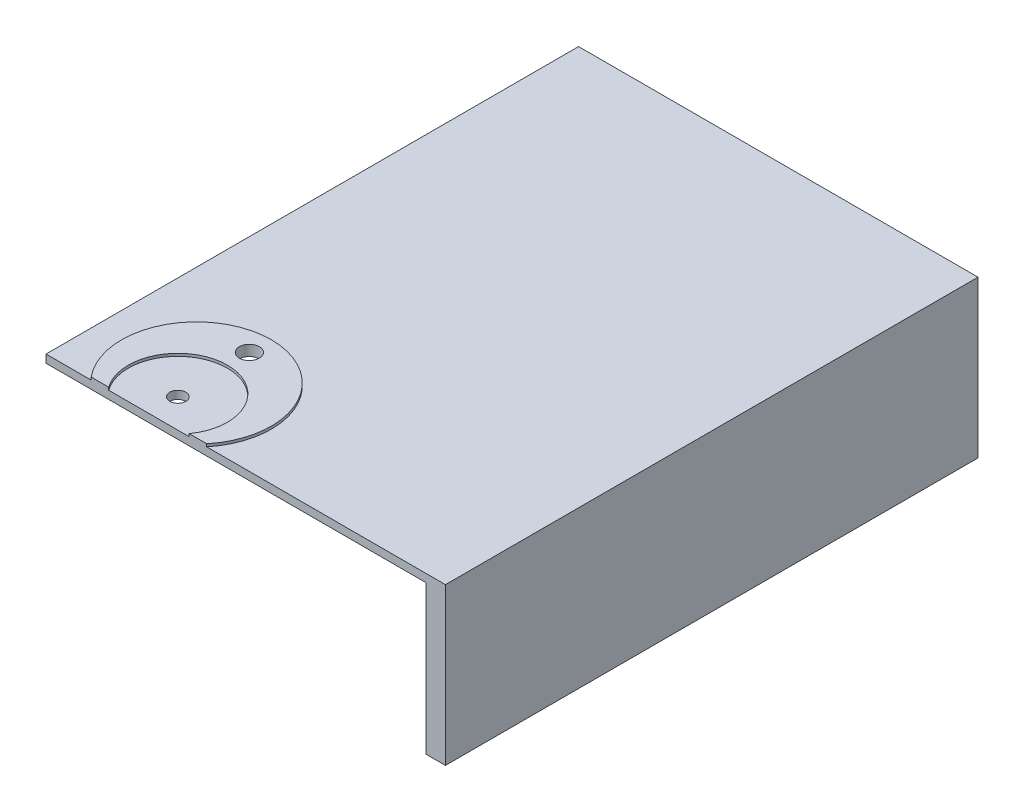
ISO-10303-21;
HEADER;
FILE_DESCRIPTION(('STEP AP214'),'2;1');
FILE_NAME('part.step','',(''),(''),'','','');
FILE_SCHEMA(('AUTOMOTIVE_DESIGN { 1 0 10303 214 1 1 1 1 }'));
ENDSEC;
DATA;
#1=APPLICATION_CONTEXT('core data for automotive mechanical design processes');
#2=APPLICATION_PROTOCOL_DEFINITION('international standard','automotive_design',2000,#1);
#3=PRODUCT_CONTEXT('',#1,'mechanical');
#4=PRODUCT('Part','Part','',(#3));
#5=PRODUCT_RELATED_PRODUCT_CATEGORY('part','',(#4));
#6=PRODUCT_DEFINITION_FORMATION('','',#4);
#7=PRODUCT_DEFINITION_CONTEXT('part definition',#1,'design');
#8=PRODUCT_DEFINITION('design','',#6,#7);
#9=PRODUCT_DEFINITION_SHAPE('','',#8);
#10=(LENGTH_UNIT() NAMED_UNIT(*) SI_UNIT(.MILLI.,.METRE.));
#11=(NAMED_UNIT(*) PLANE_ANGLE_UNIT() SI_UNIT($,.RADIAN.));
#12=(NAMED_UNIT(*) SI_UNIT($,.STERADIAN.) SOLID_ANGLE_UNIT());
#13=UNCERTAINTY_MEASURE_WITH_UNIT(LENGTH_MEASURE(1.E-05),#10,'distance_accuracy_value','');
#14=(GEOMETRIC_REPRESENTATION_CONTEXT(3) GLOBAL_UNCERTAINTY_ASSIGNED_CONTEXT((#13)) GLOBAL_UNIT_ASSIGNED_CONTEXT((#10,
#11,#12)) REPRESENTATION_CONTEXT('',''));
#15=CARTESIAN_POINT('',(0.,0.,0.));
#16=DIRECTION('',(0.,0.,1.));
#17=DIRECTION('',(1.,0.,0.));
#18=AXIS2_PLACEMENT_3D('',#15,#16,#17);
#19=CARTESIAN_POINT('',(0.,1.,0.));
#20=DIRECTION('',(0.,-1.,0.));
#21=DIRECTION('',(0.,0.,-1.));
#22=AXIS2_PLACEMENT_3D('',#19,#20,#21);
#23=CYLINDRICAL_SURFACE('',#22,28.1);
#24=CARTESIAN_POINT('',(0.,1.,0.));
#25=DIRECTION('',(0.,1.,0.));
#26=DIRECTION('',(0.,0.,1.));
#27=AXIS2_PLACEMENT_3D('',#24,#25,#26);
#28=CIRCLE('',#27,28.1);
#29=CARTESIAN_POINT('',(21.695150517663,1.,17.8586237996086));
#30=VERTEX_POINT('',#29);
#31=CARTESIAN_POINT('',(-21.695150517663,1.,17.8586237996086));
#32=VERTEX_POINT('',#31);
#33=EDGE_CURVE('E169',#30,#32,#28,.T.);
#34=ORIENTED_EDGE('',*,*,#33,.F.);
#35=DIRECTION('',(0.,-1.,0.));
#36=VECTOR('',#35,1.);
#37=CARTESIAN_POINT('',(21.695150517663,1.,17.8586237996086));
#38=LINE('',#37,#36);
#39=CARTESIAN_POINT('',(21.695150517663,0.,17.8586237996086));
#40=VERTEX_POINT('',#39);
#41=EDGE_CURVE('E253',#30,#40,#38,.T.);
#42=ORIENTED_EDGE('',*,*,#41,.T.);
#43=CARTESIAN_POINT('',(0.,0.,0.));
#44=DIRECTION('',(0.,1.,0.));
#45=DIRECTION('',(0.,0.,1.));
#46=AXIS2_PLACEMENT_3D('',#43,#44,#45);
#47=CIRCLE('',#46,28.1);
#48=CARTESIAN_POINT('',(-21.695150517663,0.,17.8586237996086));
#49=VERTEX_POINT('',#48);
#50=EDGE_CURVE('E163',#40,#49,#47,.T.);
#51=ORIENTED_EDGE('',*,*,#50,.T.);
#52=DIRECTION('',(0.,-1.,0.));
#53=VECTOR('',#52,1.);
#54=CARTESIAN_POINT('',(-21.695150517663,1.,17.8586237996086));
#55=LINE('',#54,#53);
#56=EDGE_CURVE('E249',#49,#32,#55,.F.);
#57=ORIENTED_EDGE('',*,*,#56,.T.);
#58=EDGE_LOOP('',(#34,#42,#51,#57));
#59=FACE_BOUND('',#58,.T.);
#60=ADVANCED_FACE('F39',(#59),#23,.T.);
#61=CARTESIAN_POINT('',(0.,1.,0.));
#62=DIRECTION('',(0.,1.,0.));
#63=DIRECTION('',(0.,0.,1.));
#64=AXIS2_PLACEMENT_3D('',#61,#62,#63);
#65=PLANE('',#64);
#66=DIRECTION('',(-1.,0.,0.));
#67=VECTOR('',#66,1.);
#68=CARTESIAN_POINT('',(0.,1.,17.8586237996086));
#69=LINE('',#68,#67);
#70=CARTESIAN_POINT('',(15.1013340198333,1.,17.8586237996086));
#71=VERTEX_POINT('',#70);
#72=EDGE_CURVE('E248',#30,#71,#69,.T.);
#73=ORIENTED_EDGE('',*,*,#72,.F.);
#74=ORIENTED_EDGE('',*,*,#33,.T.);
#75=CARTESIAN_POINT('',(-15.1013340198333,1.,17.8586237996086));
#76=VERTEX_POINT('',#75);
#77=EDGE_CURVE('E245',#76,#32,#69,.T.);
#78=ORIENTED_EDGE('',*,*,#77,.F.);
#79=CARTESIAN_POINT('',(0.,1.,7.));
#80=DIRECTION('',(0.,1.,0.));
#81=DIRECTION('',(0.,0.,1.));
#82=AXIS2_PLACEMENT_3D('',#79,#80,#81);
#83=CIRCLE('',#82,18.6);
#84=EDGE_CURVE('E164',#71,#76,#83,.T.);
#85=ORIENTED_EDGE('',*,*,#84,.F.);
#86=EDGE_LOOP('',(#73,#74,#78,#85));
#87=FACE_BOUND('',#86,.T.);
#88=CARTESIAN_POINT('',(0.,1.,-19.85));
#89=DIRECTION('',(0.,1.,0.));
#90=DIRECTION('',(0.,0.,1.));
#91=AXIS2_PLACEMENT_3D('',#88,#89,#90);
#92=CIRCLE('',#91,3.75);
#93=CARTESIAN_POINT('',(0.,1.,-16.1));
#94=VERTEX_POINT('',#93);
#95=EDGE_CURVE('E188',#94,#94,#92,.T.);
#96=ORIENTED_EDGE('',*,*,#95,.F.);
#97=EDGE_LOOP('',(#96));
#98=FACE_BOUND('',#97,.T.);
#99=ADVANCED_FACE('F273',(#87,#98),#65,.T.);
#100=CARTESIAN_POINT('',(0.,-57.8,7.));
#101=DIRECTION('',(0.,1.,0.));
#102=DIRECTION('',(0.,0.,1.));
#103=AXIS2_PLACEMENT_3D('',#100,#101,#102);
#104=CYLINDRICAL_SURFACE('',#103,18.6);
#105=ORIENTED_EDGE('',*,*,#84,.T.);
#106=DIRECTION('',(0.,1.,0.));
#107=VECTOR('',#106,1.);
#108=CARTESIAN_POINT('',(-15.1013340198333,-57.8,17.8586237996086));
#109=LINE('',#108,#107);
#110=CARTESIAN_POINT('',(-15.1013340198333,0.,17.8586237996086));
#111=VERTEX_POINT('',#110);
#112=EDGE_CURVE('E241',#76,#111,#109,.F.);
#113=ORIENTED_EDGE('',*,*,#112,.T.);
#114=CARTESIAN_POINT('',(0.,0.,7.));
#115=DIRECTION('',(0.,1.,0.));
#116=DIRECTION('',(0.,0.,1.));
#117=AXIS2_PLACEMENT_3D('',#114,#115,#116);
#118=CIRCLE('',#117,18.6);
#119=CARTESIAN_POINT('',(15.1013340198333,0.,17.8586237996086));
#120=VERTEX_POINT('',#119);
#121=EDGE_CURVE('E168',#120,#111,#118,.T.);
#122=ORIENTED_EDGE('',*,*,#121,.F.);
#123=DIRECTION('',(0.,1.,0.));
#124=VECTOR('',#123,1.);
#125=CARTESIAN_POINT('',(15.1013340198333,-57.8,17.8586237996086));
#126=LINE('',#125,#124);
#127=EDGE_CURVE('E237',#120,#71,#126,.T.);
#128=ORIENTED_EDGE('',*,*,#127,.T.);
#129=EDGE_LOOP('',(#105,#113,#122,#128));
#130=FACE_BOUND('',#129,.T.);
#131=ADVANCED_FACE('F278',(#130),#104,.F.);
#132=CARTESIAN_POINT('',(0.,0.,0.));
#133=DIRECTION('',(0.,-1.,0.));
#134=DIRECTION('',(0.,0.,-1.));
#135=AXIS2_PLACEMENT_3D('',#132,#133,#134);
#136=PLANE('',#135);
#137=ORIENTED_EDGE('',*,*,#50,.F.);
#138=DIRECTION('',(1.,0.,0.));
#139=VECTOR('',#138,1.);
#140=CARTESIAN_POINT('',(0.,0.,17.8586237996086));
#141=LINE('',#140,#139);
#142=CARTESIAN_POINT('',(111.341546011374,0.,17.8586237996086));
#143=VERTEX_POINT('',#142);
#144=EDGE_CURVE('E257',#40,#143,#141,.T.);
#145=ORIENTED_EDGE('',*,*,#144,.T.);
#146=DIRECTION('',(0.,0.,1.));
#147=VECTOR('',#146,1.);
#148=CARTESIAN_POINT('',(111.341546011374,0.,182.141376200391));
#149=LINE('',#148,#147);
#150=CARTESIAN_POINT('',(111.341546011374,0.,-182.141376200391));
#151=VERTEX_POINT('',#150);
#152=EDGE_CURVE('E142',#151,#143,#149,.T.);
#153=ORIENTED_EDGE('',*,*,#152,.F.);
#154=DIRECTION('',(1.,0.,0.));
#155=VECTOR('',#154,1.);
#156=CARTESIAN_POINT('',(-111.341546011374,0.,-182.141376200391));
#157=LINE('',#156,#155);
#158=CARTESIAN_POINT('',(-38.6584539886257,0.,-182.141376200391));
#159=VERTEX_POINT('',#158);
#160=EDGE_CURVE('E148',#159,#151,#157,.T.);
#161=ORIENTED_EDGE('',*,*,#160,.F.);
#162=DIRECTION('',(0.,0.,1.));
#163=VECTOR('',#162,1.);
#164=CARTESIAN_POINT('',(-38.6584539886258,0.,0.));
#165=LINE('',#164,#163);
#166=CARTESIAN_POINT('',(-38.6584539886258,0.,17.8586237996086));
#167=VERTEX_POINT('',#166);
#168=EDGE_CURVE('E225',#159,#167,#165,.T.);
#169=ORIENTED_EDGE('',*,*,#168,.T.);
#170=EDGE_CURVE('E198',#167,#49,#141,.T.);
#171=ORIENTED_EDGE('',*,*,#170,.T.);
#172=EDGE_LOOP('',(#137,#145,#153,#161,#169,#171));
#173=FACE_BOUND('',#172,.T.);
#174=ADVANCED_FACE('F266',(#173),#136,.F.);
#175=CARTESIAN_POINT('',(0.,-58.8,0.));
#176=DIRECTION('',(0.,-1.,0.));
#177=DIRECTION('',(0.,0.,-1.));
#178=AXIS2_PLACEMENT_3D('',#175,#176,#177);
#179=PLANE('',#178);
#180=DIRECTION('',(1.,0.,0.));
#181=VECTOR('',#180,1.);
#182=CARTESIAN_POINT('',(-38.6584539886258,-58.8,17.8586237996086));
#183=LINE('',#182,#181);
#184=CARTESIAN_POINT('',(103.958701758156,-58.8,17.8586237996086));
#185=VERTEX_POINT('',#184);
#186=CARTESIAN_POINT('',(111.341546011374,-58.8,17.8586237996086));
#187=VERTEX_POINT('',#186);
#188=EDGE_CURVE('E122',#185,#187,#183,.T.);
#189=ORIENTED_EDGE('',*,*,#188,.F.);
#190=DIRECTION('',(0.,0.,1.));
#191=VECTOR('',#190,1.);
#192=CARTESIAN_POINT('',(103.958701758156,-58.8,174.272148859892));
#193=LINE('',#192,#191);
#194=CARTESIAN_POINT('',(103.958701758156,-58.8,-174.272148859892));
#195=VERTEX_POINT('',#194);
#196=EDGE_CURVE('E183',#195,#185,#193,.T.);
#197=ORIENTED_EDGE('',*,*,#196,.F.);
#198=DIRECTION('',(1.,0.,0.));
#199=VECTOR('',#198,1.);
#200=CARTESIAN_POINT('',(-103.958701758156,-58.8,-174.272148859892));
#201=LINE('',#200,#199);
#202=CARTESIAN_POINT('',(-38.6584539886257,-58.8,-174.272148859892));
#203=VERTEX_POINT('',#202);
#204=EDGE_CURVE('E211',#203,#195,#201,.T.);
#205=ORIENTED_EDGE('',*,*,#204,.F.);
#206=DIRECTION('',(0.,0.,1.));
#207=VECTOR('',#206,1.);
#208=CARTESIAN_POINT('',(-38.6584539886257,-58.8,-182.141376200391));
#209=LINE('',#208,#207);
#210=CARTESIAN_POINT('',(-38.6584539886257,-58.8,-182.141376200391));
#211=VERTEX_POINT('',#210);
#212=EDGE_CURVE('E133',#211,#203,#209,.T.);
#213=ORIENTED_EDGE('',*,*,#212,.F.);
#214=DIRECTION('',(1.,0.,0.));
#215=VECTOR('',#214,1.);
#216=CARTESIAN_POINT('',(-111.341546011374,-58.8,-182.141376200391));
#217=LINE('',#216,#215);
#218=CARTESIAN_POINT('',(111.341546011374,-58.8,-182.141376200391));
#219=VERTEX_POINT('',#218);
#220=EDGE_CURVE('E63',#211,#219,#217,.T.);
#221=ORIENTED_EDGE('',*,*,#220,.T.);
#222=DIRECTION('',(0.,0.,1.));
#223=VECTOR('',#222,1.);
#224=CARTESIAN_POINT('',(111.341546011374,-58.8,182.141376200391));
#225=LINE('',#224,#223);
#226=EDGE_CURVE('E140',#219,#187,#225,.T.);
#227=ORIENTED_EDGE('',*,*,#226,.T.);
#228=EDGE_LOOP('',(#189,#197,#205,#213,#221,#227));
#229=FACE_BOUND('',#228,.T.);
#230=ADVANCED_FACE('F146',(#229),#179,.T.);
#231=CARTESIAN_POINT('',(-111.341546011374,-58.8,-182.141376200391));
#232=DIRECTION('',(0.,0.,1.));
#233=DIRECTION('',(1.,0.,0.));
#234=AXIS2_PLACEMENT_3D('',#231,#232,#233);
#235=PLANE('',#234);
#236=ORIENTED_EDGE('',*,*,#220,.F.);
#237=DIRECTION('',(0.,-1.,0.));
#238=VECTOR('',#237,1.);
#239=CARTESIAN_POINT('',(-38.6584539886257,441.2,-182.141376200391));
#240=LINE('',#239,#238);
#241=EDGE_CURVE('E144',#159,#211,#240,.T.);
#242=ORIENTED_EDGE('',*,*,#241,.F.);
#243=ORIENTED_EDGE('',*,*,#160,.T.);
#244=DIRECTION('',(0.,1.,0.));
#245=VECTOR('',#244,1.);
#246=CARTESIAN_POINT('',(111.341546011374,-58.8,-182.141376200391));
#247=LINE('',#246,#245);
#248=EDGE_CURVE('E152',#219,#151,#247,.T.);
#249=ORIENTED_EDGE('',*,*,#248,.F.);
#250=EDGE_LOOP('',(#236,#242,#243,#249));
#251=FACE_BOUND('',#250,.T.);
#252=ADVANCED_FACE('F290',(#251),#235,.F.);
#253=CARTESIAN_POINT('',(111.341546011374,-58.8,182.141376200391));
#254=DIRECTION('',(-1.,0.,0.));
#255=DIRECTION('',(0.,0.,1.));
#256=AXIS2_PLACEMENT_3D('',#253,#254,#255);
#257=PLANE('',#256);
#258=ORIENTED_EDGE('',*,*,#152,.T.);
#259=DIRECTION('',(0.,-1.,0.));
#260=VECTOR('',#259,1.);
#261=CARTESIAN_POINT('',(111.341546011374,441.2,17.8586237996086));
#262=LINE('',#261,#260);
#263=EDGE_CURVE('E126',#143,#187,#262,.T.);
#264=ORIENTED_EDGE('',*,*,#263,.T.);
#265=ORIENTED_EDGE('',*,*,#226,.F.);
#266=ORIENTED_EDGE('',*,*,#248,.T.);
#267=EDGE_LOOP('',(#258,#264,#265,#266));
#268=FACE_BOUND('',#267,.T.);
#269=ADVANCED_FACE('F138',(#268),#257,.F.);
#270=CARTESIAN_POINT('',(0.,0.,7.));
#271=DIRECTION('',(0.,1.,0.));
#272=DIRECTION('',(0.,0.,1.));
#273=AXIS2_PLACEMENT_3D('',#270,#271,#272);
#274=CIRCLE('',#273,3.);
#275=CARTESIAN_POINT('',(0.,0.,10.));
#276=VERTEX_POINT('',#275);
#277=EDGE_CURVE('E184',#276,#276,#274,.T.);
#278=ORIENTED_EDGE('',*,*,#277,.F.);
#279=EDGE_LOOP('',(#278));
#280=FACE_BOUND('',#279,.T.);
#281=ORIENTED_EDGE('',*,*,#121,.T.);
#282=DIRECTION('',(1.,0.,0.));
#283=VECTOR('',#282,1.);
#284=CARTESIAN_POINT('',(0.,0.,17.8586237996086));
#285=LINE('',#284,#283);
#286=EDGE_CURVE('E233',#111,#120,#285,.T.);
#287=ORIENTED_EDGE('',*,*,#286,.T.);
#288=EDGE_LOOP('',(#281,#287));
#289=FACE_BOUND('',#288,.T.);
#290=ADVANCED_FACE('F281',(#280,#289),#136,.F.);
#291=CARTESIAN_POINT('',(103.958701758156,-3.,174.272148859892));
#292=DIRECTION('',(1.,0.,0.));
#293=DIRECTION('',(0.,0.,-1.));
#294=AXIS2_PLACEMENT_3D('',#291,#292,#293);
#295=PLANE('',#294);
#296=ORIENTED_EDGE('',*,*,#196,.T.);
#297=DIRECTION('',(0.,1.,0.));
#298=VECTOR('',#297,1.);
#299=CARTESIAN_POINT('',(103.958701758156,-3.,17.8586237996086));
#300=LINE('',#299,#298);
#301=CARTESIAN_POINT('',(103.958701758156,-3.,17.8586237996086));
#302=VERTEX_POINT('',#301);
#303=EDGE_CURVE('E129',#185,#302,#300,.T.);
#304=ORIENTED_EDGE('',*,*,#303,.T.);
#305=DIRECTION('',(0.,0.,1.));
#306=VECTOR('',#305,1.);
#307=CARTESIAN_POINT('',(103.958701758156,-3.,174.272148859892));
#308=LINE('',#307,#306);
#309=CARTESIAN_POINT('',(103.958701758156,-3.,-174.272148859892));
#310=VERTEX_POINT('',#309);
#311=EDGE_CURVE('E205',#310,#302,#308,.T.);
#312=ORIENTED_EDGE('',*,*,#311,.F.);
#313=DIRECTION('',(0.,-1.,0.));
#314=VECTOR('',#313,1.);
#315=CARTESIAN_POINT('',(103.958701758156,-3.,-174.272148859892));
#316=LINE('',#315,#314);
#317=EDGE_CURVE('E156',#310,#195,#316,.T.);
#318=ORIENTED_EDGE('',*,*,#317,.T.);
#319=EDGE_LOOP('',(#296,#304,#312,#318));
#320=FACE_BOUND('',#319,.T.);
#321=ADVANCED_FACE('F220',(#320),#295,.F.);
#322=CARTESIAN_POINT('',(-103.958701758156,-3.,-174.272148859892));
#323=DIRECTION('',(0.,0.,-1.));
#324=DIRECTION('',(-1.,0.,0.));
#325=AXIS2_PLACEMENT_3D('',#322,#323,#324);
#326=PLANE('',#325);
#327=DIRECTION('',(1.,0.,0.));
#328=VECTOR('',#327,1.);
#329=CARTESIAN_POINT('',(-103.958701758156,-3.,-174.272148859892));
#330=LINE('',#329,#328);
#331=CARTESIAN_POINT('',(-38.6584539886258,-3.,-174.272148859892));
#332=VERTEX_POINT('',#331);
#333=EDGE_CURVE('E206',#332,#310,#330,.T.);
#334=ORIENTED_EDGE('',*,*,#333,.F.);
#335=DIRECTION('',(0.,-1.,0.));
#336=VECTOR('',#335,1.);
#337=CARTESIAN_POINT('',(-38.6584539886257,-3.,-174.272148859892));
#338=LINE('',#337,#336);
#339=EDGE_CURVE('E54',#332,#203,#338,.T.);
#340=ORIENTED_EDGE('',*,*,#339,.T.);
#341=ORIENTED_EDGE('',*,*,#204,.T.);
#342=ORIENTED_EDGE('',*,*,#317,.F.);
#343=EDGE_LOOP('',(#334,#340,#341,#342));
#344=FACE_BOUND('',#343,.T.);
#345=ADVANCED_FACE('F223',(#344),#326,.F.);
#346=CARTESIAN_POINT('',(0.,-3.,0.));
#347=DIRECTION('',(0.,-1.,0.));
#348=DIRECTION('',(0.,0.,-1.));
#349=AXIS2_PLACEMENT_3D('',#346,#347,#348);
#350=PLANE('',#349);
#351=DIRECTION('',(1.,0.,0.));
#352=VECTOR('',#351,1.);
#353=CARTESIAN_POINT('',(0.,-3.,17.8586237996086));
#354=LINE('',#353,#352);
#355=CARTESIAN_POINT('',(-38.6584539886258,-3.,17.8586237996086));
#356=VERTEX_POINT('',#355);
#357=EDGE_CURVE('E11',#356,#302,#354,.T.);
#358=ORIENTED_EDGE('',*,*,#357,.F.);
#359=DIRECTION('',(0.,0.,1.));
#360=VECTOR('',#359,1.);
#361=CARTESIAN_POINT('',(-38.6584539886258,-3.,0.));
#362=LINE('',#361,#360);
#363=EDGE_CURVE('E47',#332,#356,#362,.T.);
#364=ORIENTED_EDGE('',*,*,#363,.F.);
#365=ORIENTED_EDGE('',*,*,#333,.T.);
#366=ORIENTED_EDGE('',*,*,#311,.T.);
#367=EDGE_LOOP('',(#358,#364,#365,#366));
#368=FACE_BOUND('',#367,.T.);
#369=CARTESIAN_POINT('',(0.,-3.,-19.85));
#370=DIRECTION('',(0.,-1.,0.));
#371=DIRECTION('',(0.,0.,-1.));
#372=AXIS2_PLACEMENT_3D('',#369,#370,#371);
#373=CIRCLE('',#372,3.75);
#374=CARTESIAN_POINT('',(0.,-3.,-23.6));
#375=VERTEX_POINT('',#374);
#376=EDGE_CURVE('E185',#375,#375,#373,.T.);
#377=ORIENTED_EDGE('',*,*,#376,.F.);
#378=EDGE_LOOP('',(#377));
#379=FACE_BOUND('',#378,.T.);
#380=CARTESIAN_POINT('',(0.,-3.,7.));
#381=DIRECTION('',(0.,-1.,0.));
#382=DIRECTION('',(0.,0.,-1.));
#383=AXIS2_PLACEMENT_3D('',#380,#381,#382);
#384=CIRCLE('',#383,3.);
#385=CARTESIAN_POINT('',(0.,-3.,4.));
#386=VERTEX_POINT('',#385);
#387=EDGE_CURVE('E179',#386,#386,#384,.T.);
#388=ORIENTED_EDGE('',*,*,#387,.F.);
#389=EDGE_LOOP('',(#388));
#390=FACE_BOUND('',#389,.T.);
#391=ADVANCED_FACE('F202',(#368,#379,#390),#350,.T.);
#392=CARTESIAN_POINT('',(0.,-10.,7.));
#393=DIRECTION('',(0.,1.,0.));
#394=DIRECTION('',(0.,0.,1.));
#395=AXIS2_PLACEMENT_3D('',#392,#393,#394);
#396=CYLINDRICAL_SURFACE('',#395,3.);
#397=ORIENTED_EDGE('',*,*,#387,.T.);
#398=EDGE_LOOP('',(#397));
#399=FACE_BOUND('',#398,.T.);
#400=ORIENTED_EDGE('',*,*,#277,.T.);
#401=EDGE_LOOP('',(#400));
#402=FACE_BOUND('',#401,.T.);
#403=ADVANCED_FACE('F320',(#399,#402),#396,.F.);
#404=CARTESIAN_POINT('',(0.,-9.,-19.85));
#405=DIRECTION('',(0.,1.,0.));
#406=DIRECTION('',(0.,0.,1.));
#407=AXIS2_PLACEMENT_3D('',#404,#405,#406);
#408=CYLINDRICAL_SURFACE('',#407,3.75);
#409=ORIENTED_EDGE('',*,*,#376,.T.);
#410=EDGE_LOOP('',(#409));
#411=FACE_BOUND('',#410,.T.);
#412=ORIENTED_EDGE('',*,*,#95,.T.);
#413=EDGE_LOOP('',(#412));
#414=FACE_BOUND('',#413,.T.);
#415=ADVANCED_FACE('F323',(#411,#414),#408,.F.);
#416=CARTESIAN_POINT('',(-38.6584539886258,441.2,17.8586237996086));
#417=DIRECTION('',(0.,0.,-1.));
#418=DIRECTION('',(-1.,0.,0.));
#419=AXIS2_PLACEMENT_3D('',#416,#417,#418);
#420=PLANE('',#419);
#421=DIRECTION('',(0.,-1.,0.));
#422=VECTOR('',#421,1.);
#423=CARTESIAN_POINT('',(-38.6584539886258,441.2,17.8586237996086));
#424=LINE('',#423,#422);
#425=EDGE_CURVE('E192',#167,#356,#424,.T.);
#426=ORIENTED_EDGE('',*,*,#425,.T.);
#427=ORIENTED_EDGE('',*,*,#357,.T.);
#428=ORIENTED_EDGE('',*,*,#303,.F.);
#429=ORIENTED_EDGE('',*,*,#188,.T.);
#430=ORIENTED_EDGE('',*,*,#263,.F.);
#431=ORIENTED_EDGE('',*,*,#144,.F.);
#432=ORIENTED_EDGE('',*,*,#41,.F.);
#433=ORIENTED_EDGE('',*,*,#72,.T.);
#434=ORIENTED_EDGE('',*,*,#127,.F.);
#435=ORIENTED_EDGE('',*,*,#286,.F.);
#436=ORIENTED_EDGE('',*,*,#112,.F.);
#437=ORIENTED_EDGE('',*,*,#77,.T.);
#438=ORIENTED_EDGE('',*,*,#56,.F.);
#439=ORIENTED_EDGE('',*,*,#170,.F.);
#440=EDGE_LOOP('',(#426,#427,#428,#429,#430,#431,#432,#433,#434,#435,#436,#437,#438,#439));
#441=FACE_BOUND('',#440,.T.);
#442=ADVANCED_FACE('F125',(#441),#420,.F.);
#443=CARTESIAN_POINT('',(-38.6584539886257,441.2,-182.141376200391));
#444=DIRECTION('',(1.,0.,0.));
#445=DIRECTION('',(0.,0.,-1.));
#446=AXIS2_PLACEMENT_3D('',#443,#444,#445);
#447=PLANE('',#446);
#448=ORIENTED_EDGE('',*,*,#241,.T.);
#449=ORIENTED_EDGE('',*,*,#212,.T.);
#450=ORIENTED_EDGE('',*,*,#339,.F.);
#451=ORIENTED_EDGE('',*,*,#363,.T.);
#452=ORIENTED_EDGE('',*,*,#425,.F.);
#453=ORIENTED_EDGE('',*,*,#168,.F.);
#454=EDGE_LOOP('',(#448,#449,#450,#451,#452,#453));
#455=FACE_BOUND('',#454,.T.);
#456=ADVANCED_FACE('F191',(#455),#447,.F.);
#457=CLOSED_SHELL('',(#60,#99,#131,#174,#230,#252,#269,#290,#321,#345,#391,#403,#415,#442,#456));
#458=MANIFOLD_SOLID_BREP('B2',#457);
#459=ADVANCED_BREP_SHAPE_REPRESENTATION('',(#18,#458),#14);
#460=SHAPE_DEFINITION_REPRESENTATION(#9,#459);
ENDSEC;
END-ISO-10303-21;
